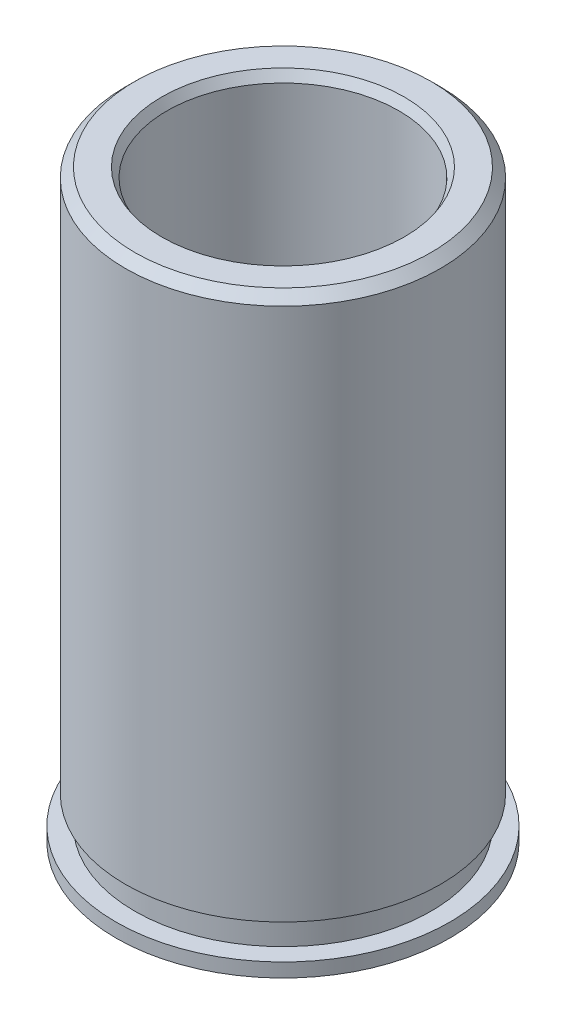
ISO-10303-21;
HEADER;
FILE_DESCRIPTION(('STEP AP214'),'2;1');
FILE_NAME('part.step','',(''),(''),'','','');
FILE_SCHEMA(('AUTOMOTIVE_DESIGN { 1 0 10303 214 1 1 1 1 }'));
ENDSEC;
DATA;
#1=APPLICATION_CONTEXT('core data for automotive mechanical design processes');
#2=APPLICATION_PROTOCOL_DEFINITION('international standard','automotive_design',2000,#1);
#3=PRODUCT_CONTEXT('',#1,'mechanical');
#4=PRODUCT('Part','Part','',(#3));
#5=PRODUCT_RELATED_PRODUCT_CATEGORY('part','',(#4));
#6=PRODUCT_DEFINITION_FORMATION('','',#4);
#7=PRODUCT_DEFINITION_CONTEXT('part definition',#1,'design');
#8=PRODUCT_DEFINITION('design','',#6,#7);
#9=PRODUCT_DEFINITION_SHAPE('','',#8);
#10=(LENGTH_UNIT() NAMED_UNIT(*) SI_UNIT(.MILLI.,.METRE.));
#11=(NAMED_UNIT(*) PLANE_ANGLE_UNIT() SI_UNIT($,.RADIAN.));
#12=(NAMED_UNIT(*) SI_UNIT($,.STERADIAN.) SOLID_ANGLE_UNIT());
#13=UNCERTAINTY_MEASURE_WITH_UNIT(LENGTH_MEASURE(1.E-05),#10,'distance_accuracy_value','');
#14=(GEOMETRIC_REPRESENTATION_CONTEXT(3) GLOBAL_UNCERTAINTY_ASSIGNED_CONTEXT((#13)) GLOBAL_UNIT_ASSIGNED_CONTEXT((#10,
#11,#12)) REPRESENTATION_CONTEXT('',''));
#15=CARTESIAN_POINT('',(0.,0.,0.));
#16=DIRECTION('',(0.,0.,1.));
#17=DIRECTION('',(1.,0.,0.));
#18=AXIS2_PLACEMENT_3D('',#15,#16,#17);
#19=CARTESIAN_POINT('',(-23.5683157550284,40.6850551226155,-9.7683856695312));
#20=DIRECTION('',(0.,1.,0.));
#21=DIRECTION('',(0.,0.,1.));
#22=AXIS2_PLACEMENT_3D('',#19,#20,#21);
#23=CYLINDRICAL_SURFACE('',#22,4.572);
#24=CARTESIAN_POINT('',(-23.5683157550284,24.6830551226155,-9.7683856695312));
#25=DIRECTION('',(0.,1.,0.));
#26=DIRECTION('',(0.,0.,1.));
#27=AXIS2_PLACEMENT_3D('',#24,#25,#26);
#28=CIRCLE('',#27,4.572);
#29=CARTESIAN_POINT('',(-23.5683157550284,24.6830551226155,-5.1963856695312));
#30=VERTEX_POINT('',#29);
#31=EDGE_CURVE('E51',#30,#30,#28,.T.);
#32=ORIENTED_EDGE('',*,*,#31,.T.);
#33=EDGE_LOOP('',(#32));
#34=FACE_BOUND('',#33,.T.);
#35=CARTESIAN_POINT('',(-23.5683157550284,25.0640551226155,-9.7683856695312));
#36=DIRECTION('',(0.,1.,0.));
#37=DIRECTION('',(0.,0.,1.));
#38=AXIS2_PLACEMENT_3D('',#35,#36,#37);
#39=CIRCLE('',#38,4.572);
#40=CARTESIAN_POINT('',(-23.5683157550284,25.0640551226155,-5.1963856695312));
#41=VERTEX_POINT('',#40);
#42=EDGE_CURVE('E9',#41,#41,#39,.T.);
#43=ORIENTED_EDGE('',*,*,#42,.F.);
#44=EDGE_LOOP('',(#43));
#45=FACE_BOUND('',#44,.T.);
#46=ADVANCED_FACE('F14',(#34,#45),#23,.T.);
#47=CARTESIAN_POINT('',(-21.2823157550284,25.0640551226155,-9.7683856695312));
#48=DIRECTION('',(0.,1.,0.));
#49=DIRECTION('',(0.,0.,1.));
#50=AXIS2_PLACEMENT_3D('',#47,#48,#49);
#51=PLANE('',#50);
#52=ORIENTED_EDGE('',*,*,#42,.T.);
#53=EDGE_LOOP('',(#52));
#54=FACE_BOUND('',#53,.T.);
#55=CARTESIAN_POINT('',(-23.5683157550284,25.0640551226155,-9.7683856695312));
#56=DIRECTION('',(0.,1.,0.));
#57=DIRECTION('',(0.,0.,1.));
#58=AXIS2_PLACEMENT_3D('',#55,#56,#57);
#59=CIRCLE('',#58,4.05765);
#60=CARTESIAN_POINT('',(-23.5683157550284,25.0640551226155,-5.7107356695312));
#61=VERTEX_POINT('',#60);
#62=EDGE_CURVE('E20',#61,#61,#59,.T.);
#63=ORIENTED_EDGE('',*,*,#62,.F.);
#64=EDGE_LOOP('',(#63));
#65=FACE_BOUND('',#64,.T.);
#66=ADVANCED_FACE('F77',(#54,#65),#51,.T.);
#67=CARTESIAN_POINT('',(-23.5683157550284,40.6850551226155,-9.7683856695312));
#68=DIRECTION('',(0.,1.,0.));
#69=DIRECTION('',(0.,0.,1.));
#70=AXIS2_PLACEMENT_3D('',#67,#68,#69);
#71=CYLINDRICAL_SURFACE('',#70,4.05765);
#72=ORIENTED_EDGE('',*,*,#62,.T.);
#73=EDGE_LOOP('',(#72));
#74=FACE_BOUND('',#73,.T.);
#75=CARTESIAN_POINT('',(-23.5683157550284,25.8260551226155,-9.7683856695312));
#76=DIRECTION('',(0.,1.,0.));
#77=DIRECTION('',(0.,0.,1.));
#78=AXIS2_PLACEMENT_3D('',#75,#76,#77);
#79=CIRCLE('',#78,4.05765);
#80=CARTESIAN_POINT('',(-23.5683157550284,25.8260551226155,-5.7107356695312));
#81=VERTEX_POINT('',#80);
#82=EDGE_CURVE('E24',#81,#81,#79,.T.);
#83=ORIENTED_EDGE('',*,*,#82,.F.);
#84=EDGE_LOOP('',(#83));
#85=FACE_BOUND('',#84,.T.);
#86=ADVANCED_FACE('F81',(#74,#85),#71,.T.);
#87=CARTESIAN_POINT('',(-21.2823157550284,25.8260551226155,-9.7683856695312));
#88=DIRECTION('',(0.,-1.,0.));
#89=DIRECTION('',(0.,0.,-1.));
#90=AXIS2_PLACEMENT_3D('',#87,#88,#89);
#91=PLANE('',#90);
#92=ORIENTED_EDGE('',*,*,#82,.T.);
#93=EDGE_LOOP('',(#92));
#94=FACE_BOUND('',#93,.T.);
#95=CARTESIAN_POINT('',(-23.5683157550284,25.8260551226155,-9.7683856695312));
#96=DIRECTION('',(0.,1.,0.));
#97=DIRECTION('',(0.,0.,1.));
#98=AXIS2_PLACEMENT_3D('',#95,#96,#97);
#99=CIRCLE('',#98,4.31165);
#100=CARTESIAN_POINT('',(-23.5683157550284,25.8260551226155,-5.4567356695312));
#101=VERTEX_POINT('',#100);
#102=EDGE_CURVE('E28',#101,#101,#99,.T.);
#103=ORIENTED_EDGE('',*,*,#102,.F.);
#104=EDGE_LOOP('',(#103));
#105=FACE_BOUND('',#104,.T.);
#106=ADVANCED_FACE('F85',(#94,#105),#91,.T.);
#107=CARTESIAN_POINT('',(-23.5683157550284,40.6850551226155,-9.7683856695312));
#108=DIRECTION('',(0.,1.,0.));
#109=DIRECTION('',(0.,0.,1.));
#110=AXIS2_PLACEMENT_3D('',#107,#108,#109);
#111=CYLINDRICAL_SURFACE('',#110,4.31165);
#112=ORIENTED_EDGE('',*,*,#102,.T.);
#113=EDGE_LOOP('',(#112));
#114=FACE_BOUND('',#113,.T.);
#115=CARTESIAN_POINT('',(-23.5683157550284,40.4310551226155,-9.7683856695312));
#116=DIRECTION('',(0.,1.,0.));
#117=DIRECTION('',(0.,0.,1.));
#118=AXIS2_PLACEMENT_3D('',#115,#116,#117);
#119=CIRCLE('',#118,4.31165);
#120=CARTESIAN_POINT('',(-23.5683157550284,40.4310551226155,-5.4567356695312));
#121=VERTEX_POINT('',#120);
#122=EDGE_CURVE('E33',#121,#121,#119,.T.);
#123=ORIENTED_EDGE('',*,*,#122,.F.);
#124=EDGE_LOOP('',(#123));
#125=FACE_BOUND('',#124,.T.);
#126=ADVANCED_FACE('F91',(#114,#125),#111,.T.);
#127=CARTESIAN_POINT('',(-23.5683157550284,40.6850551226155,-9.7683856695312));
#128=DIRECTION('',(0.,-1.,0.));
#129=DIRECTION('',(0.,0.,-1.));
#130=AXIS2_PLACEMENT_3D('',#127,#128,#129);
#131=CONICAL_SURFACE('',#130,4.05765,0.785398163397447);
#132=ORIENTED_EDGE('',*,*,#122,.T.);
#133=EDGE_LOOP('',(#132));
#134=FACE_BOUND('',#133,.T.);
#135=CARTESIAN_POINT('',(-23.5683157550284,40.6850551226155,-9.7683856695312));
#136=DIRECTION('',(0.,1.,0.));
#137=DIRECTION('',(0.,0.,1.));
#138=AXIS2_PLACEMENT_3D('',#135,#136,#137);
#139=CIRCLE('',#138,4.05765);
#140=CARTESIAN_POINT('',(-23.5683157550284,40.6850551226155,-5.7107356695312));
#141=VERTEX_POINT('',#140);
#142=EDGE_CURVE('E36',#141,#141,#139,.T.);
#143=ORIENTED_EDGE('',*,*,#142,.F.);
#144=EDGE_LOOP('',(#143));
#145=FACE_BOUND('',#144,.T.);
#146=ADVANCED_FACE('F95',(#134,#145),#131,.T.);
#147=CARTESIAN_POINT('',(-21.2823157550284,40.6850551226155,-9.7683856695312));
#148=DIRECTION('',(0.,1.,0.));
#149=DIRECTION('',(0.,0.,1.));
#150=AXIS2_PLACEMENT_3D('',#147,#148,#149);
#151=PLANE('',#150);
#152=ORIENTED_EDGE('',*,*,#142,.T.);
#153=EDGE_LOOP('',(#152));
#154=FACE_BOUND('',#153,.T.);
#155=CARTESIAN_POINT('',(-23.5683157550284,40.6850551226155,-9.7683856695312));
#156=DIRECTION('',(0.,1.,0.));
#157=DIRECTION('',(0.,0.,1.));
#158=AXIS2_PLACEMENT_3D('',#155,#156,#157);
#159=CIRCLE('',#158,3.32164696837416);
#160=CARTESIAN_POINT('',(-23.5683157550284,40.6850551226155,-6.44673870115704));
#161=VERTEX_POINT('',#160);
#162=EDGE_CURVE('E39',#161,#161,#159,.T.);
#163=ORIENTED_EDGE('',*,*,#162,.F.);
#164=EDGE_LOOP('',(#163));
#165=FACE_BOUND('',#164,.T.);
#166=ADVANCED_FACE('F99',(#154,#165),#151,.T.);
#167=CARTESIAN_POINT('',(-23.5683157550284,40.4310551226155,-9.7683856695312));
#168=DIRECTION('',(0.,1.,0.));
#169=DIRECTION('',(0.,0.,1.));
#170=AXIS2_PLACEMENT_3D('',#167,#168,#169);
#171=CONICAL_SURFACE('',#170,3.175,0.52359877559829);
#172=ORIENTED_EDGE('',*,*,#162,.T.);
#173=EDGE_LOOP('',(#172));
#174=FACE_BOUND('',#173,.T.);
#175=CARTESIAN_POINT('',(-23.5683157550284,40.4310551226155,-9.7683856695312));
#176=DIRECTION('',(0.,1.,0.));
#177=DIRECTION('',(0.,0.,1.));
#178=AXIS2_PLACEMENT_3D('',#175,#176,#177);
#179=CIRCLE('',#178,3.175);
#180=CARTESIAN_POINT('',(-23.5683157550284,40.4310551226155,-6.5933856695312));
#181=VERTEX_POINT('',#180);
#182=EDGE_CURVE('E42',#181,#181,#179,.T.);
#183=ORIENTED_EDGE('',*,*,#182,.F.);
#184=EDGE_LOOP('',(#183));
#185=FACE_BOUND('',#184,.T.);
#186=ADVANCED_FACE('F73',(#174,#185),#171,.F.);
#187=CARTESIAN_POINT('',(-23.5683157550284,40.6850551226155,-9.7683856695312));
#188=DIRECTION('',(0.,1.,0.));
#189=DIRECTION('',(0.,0.,1.));
#190=AXIS2_PLACEMENT_3D('',#187,#188,#189);
#191=CYLINDRICAL_SURFACE('',#190,3.175);
#192=ORIENTED_EDGE('',*,*,#182,.T.);
#193=EDGE_LOOP('',(#192));
#194=FACE_BOUND('',#193,.T.);
#195=CARTESIAN_POINT('',(-23.5683157550284,24.9370551226155,-9.7683856695312));
#196=DIRECTION('',(0.,1.,0.));
#197=DIRECTION('',(0.,0.,1.));
#198=AXIS2_PLACEMENT_3D('',#195,#196,#197);
#199=CIRCLE('',#198,3.175);
#200=CARTESIAN_POINT('',(-23.5683157550284,24.9370551226155,-6.5933856695312));
#201=VERTEX_POINT('',#200);
#202=EDGE_CURVE('E45',#201,#201,#199,.T.);
#203=ORIENTED_EDGE('',*,*,#202,.F.);
#204=EDGE_LOOP('',(#203));
#205=FACE_BOUND('',#204,.T.);
#206=ADVANCED_FACE('F65',(#194,#205),#191,.F.);
#207=CARTESIAN_POINT('',(-23.5683157550284,24.6830551226155,-9.7683856695312));
#208=DIRECTION('',(0.,-1.,0.));
#209=DIRECTION('',(0.,0.,-1.));
#210=AXIS2_PLACEMENT_3D('',#207,#208,#209);
#211=CONICAL_SURFACE('',#210,3.32164696837417,0.523598775598299);
#212=ORIENTED_EDGE('',*,*,#202,.T.);
#213=EDGE_LOOP('',(#212));
#214=FACE_BOUND('',#213,.T.);
#215=CARTESIAN_POINT('',(-23.5683157550284,24.6830551226155,-9.7683856695312));
#216=DIRECTION('',(0.,1.,0.));
#217=DIRECTION('',(0.,0.,1.));
#218=AXIS2_PLACEMENT_3D('',#215,#216,#217);
#219=CIRCLE('',#218,3.32164696837417);
#220=CARTESIAN_POINT('',(-23.5683157550284,24.6830551226155,-6.44673870115703));
#221=VERTEX_POINT('',#220);
#222=EDGE_CURVE('E48',#221,#221,#219,.T.);
#223=ORIENTED_EDGE('',*,*,#222,.F.);
#224=EDGE_LOOP('',(#223));
#225=FACE_BOUND('',#224,.T.);
#226=ADVANCED_FACE('F60',(#214,#225),#211,.F.);
#227=CARTESIAN_POINT('',(-21.2823157550284,24.6830551226155,-9.7683856695312));
#228=DIRECTION('',(0.,1.,0.));
#229=DIRECTION('',(0.,0.,1.));
#230=AXIS2_PLACEMENT_3D('',#227,#228,#229);
#231=PLANE('',#230);
#232=ORIENTED_EDGE('',*,*,#31,.F.);
#233=EDGE_LOOP('',(#232));
#234=FACE_BOUND('',#233,.T.);
#235=ORIENTED_EDGE('',*,*,#222,.T.);
#236=EDGE_LOOP('',(#235));
#237=FACE_BOUND('',#236,.T.);
#238=ADVANCED_FACE('F57',(#234,#237),#231,.F.);
#239=CLOSED_SHELL('',(#46,#66,#86,#106,#126,#146,#166,#186,#206,#226,#238));
#240=MANIFOLD_SOLID_BREP('B1',#239);
#241=ADVANCED_BREP_SHAPE_REPRESENTATION('',(#18,#240),#14);
#242=SHAPE_DEFINITION_REPRESENTATION(#9,#241);
ENDSEC;
END-ISO-10303-21;
